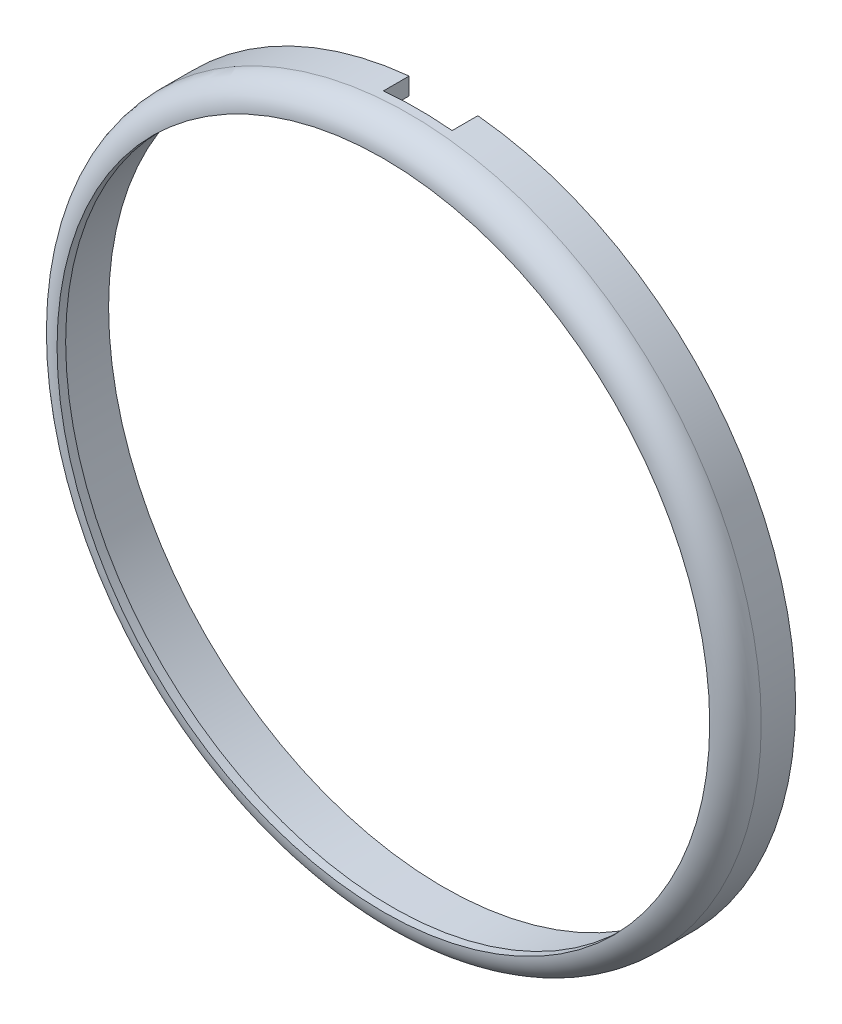
ISO-10303-21;
HEADER;
FILE_DESCRIPTION(('STEP AP214'),'2;1');
FILE_NAME('part.step','',(''),(''),'','','');
FILE_SCHEMA(('AUTOMOTIVE_DESIGN { 1 0 10303 214 1 1 1 1 }'));
ENDSEC;
DATA;
#1=APPLICATION_CONTEXT('core data for automotive mechanical design processes');
#2=APPLICATION_PROTOCOL_DEFINITION('international standard','automotive_design',2000,#1);
#3=PRODUCT_CONTEXT('',#1,'mechanical');
#4=PRODUCT('Part','Part','',(#3));
#5=PRODUCT_RELATED_PRODUCT_CATEGORY('part','',(#4));
#6=PRODUCT_DEFINITION_FORMATION('','',#4);
#7=PRODUCT_DEFINITION_CONTEXT('part definition',#1,'design');
#8=PRODUCT_DEFINITION('design','',#6,#7);
#9=PRODUCT_DEFINITION_SHAPE('','',#8);
#10=(LENGTH_UNIT() NAMED_UNIT(*) SI_UNIT(.MILLI.,.METRE.));
#11=(NAMED_UNIT(*) PLANE_ANGLE_UNIT() SI_UNIT($,.RADIAN.));
#12=(NAMED_UNIT(*) SI_UNIT($,.STERADIAN.) SOLID_ANGLE_UNIT());
#13=UNCERTAINTY_MEASURE_WITH_UNIT(LENGTH_MEASURE(1.E-05),#10,'distance_accuracy_value','');
#14=(GEOMETRIC_REPRESENTATION_CONTEXT(3) GLOBAL_UNCERTAINTY_ASSIGNED_CONTEXT((#13)) GLOBAL_UNIT_ASSIGNED_CONTEXT((#10,
#11,#12)) REPRESENTATION_CONTEXT('',''));
#15=CARTESIAN_POINT('',(0.,0.,0.));
#16=DIRECTION('',(0.,0.,1.));
#17=DIRECTION('',(1.,0.,0.));
#18=AXIS2_PLACEMENT_3D('',#15,#16,#17);
#19=CARTESIAN_POINT('',(0.,0.,3.5));
#20=DIRECTION('',(0.,0.,-1.));
#21=DIRECTION('',(-1.,0.,0.));
#22=AXIS2_PLACEMENT_3D('',#19,#20,#21);
#23=CYLINDRICAL_SURFACE('',#22,20.5);
#24=CARTESIAN_POINT('',(0.,0.,2.));
#25=DIRECTION('',(0.,0.,1.));
#26=DIRECTION('',(1.,0.,0.));
#27=AXIS2_PLACEMENT_3D('',#24,#25,#26);
#28=CIRCLE('',#27,20.5);
#29=CARTESIAN_POINT('',(20.5,0.,2.));
#30=VERTEX_POINT('',#29);
#31=EDGE_CURVE('E11',#30,#30,#28,.F.);
#32=ORIENTED_EDGE('',*,*,#31,.T.);
#33=EDGE_LOOP('',(#32));
#34=FACE_BOUND('',#33,.T.);
#35=CARTESIAN_POINT('',(0.,0.,0.));
#36=DIRECTION('',(0.,0.,1.));
#37=DIRECTION('',(1.,0.,0.));
#38=AXIS2_PLACEMENT_3D('',#35,#36,#37);
#39=CIRCLE('',#38,20.5);
#40=CARTESIAN_POINT('',(-2.,20.4022057631032,0.));
#41=VERTEX_POINT('',#40);
#42=CARTESIAN_POINT('',(2.,20.4022057631032,0.));
#43=VERTEX_POINT('',#42);
#44=EDGE_CURVE('E104',#41,#43,#39,.T.);
#45=ORIENTED_EDGE('',*,*,#44,.T.);
#46=DIRECTION('',(0.,0.,-1.));
#47=VECTOR('',#46,1.);
#48=CARTESIAN_POINT('',(2.,20.4022057631032,3.5));
#49=LINE('',#48,#47);
#50=CARTESIAN_POINT('',(2.,20.4022057631032,1.5));
#51=VERTEX_POINT('',#50);
#52=EDGE_CURVE('E93',#43,#51,#49,.F.);
#53=ORIENTED_EDGE('',*,*,#52,.T.);
#54=CARTESIAN_POINT('',(0.,0.,1.5));
#55=DIRECTION('',(0.,0.,1.));
#56=DIRECTION('',(1.,0.,0.));
#57=AXIS2_PLACEMENT_3D('',#54,#55,#56);
#58=CIRCLE('',#57,20.5);
#59=CARTESIAN_POINT('',(-2.,20.4022057631032,1.5));
#60=VERTEX_POINT('',#59);
#61=EDGE_CURVE('E106',#51,#60,#58,.T.);
#62=ORIENTED_EDGE('',*,*,#61,.T.);
#63=DIRECTION('',(0.,0.,-1.));
#64=VECTOR('',#63,1.);
#65=CARTESIAN_POINT('',(-2.,20.4022057631032,3.5));
#66=LINE('',#65,#64);
#67=EDGE_CURVE('E100',#60,#41,#66,.T.);
#68=ORIENTED_EDGE('',*,*,#67,.T.);
#69=EDGE_LOOP('',(#45,#53,#62,#68));
#70=FACE_BOUND('',#69,.T.);
#71=ADVANCED_FACE('F36',(#34,#70),#23,.T.);
#72=CARTESIAN_POINT('',(0.,0.,0.));
#73=DIRECTION('',(0.,0.,1.));
#74=DIRECTION('',(1.,0.,0.));
#75=AXIS2_PLACEMENT_3D('',#72,#73,#74);
#76=PLANE('',#75);
#77=DIRECTION('',(0.,1.,0.));
#78=VECTOR('',#77,1.);
#79=CARTESIAN_POINT('',(-2.,10.,0.));
#80=LINE('',#79,#78);
#81=CARTESIAN_POINT('',(-2.,19.3971647412708,0.));
#82=VERTEX_POINT('',#81);
#83=EDGE_CURVE('E87',#82,#41,#80,.T.);
#84=ORIENTED_EDGE('',*,*,#83,.F.);
#85=CARTESIAN_POINT('',(0.,0.,0.));
#86=DIRECTION('',(0.,0.,-1.));
#87=DIRECTION('',(-1.,0.,0.));
#88=AXIS2_PLACEMENT_3D('',#85,#86,#87);
#89=CIRCLE('',#88,19.5);
#90=CARTESIAN_POINT('',(2.,19.3971647412708,0.));
#91=VERTEX_POINT('',#90);
#92=EDGE_CURVE('E51',#91,#82,#89,.T.);
#93=ORIENTED_EDGE('',*,*,#92,.F.);
#94=DIRECTION('',(0.,1.,0.));
#95=VECTOR('',#94,1.);
#96=CARTESIAN_POINT('',(2.,10.,0.));
#97=LINE('',#96,#95);
#98=EDGE_CURVE('E81',#91,#43,#97,.T.);
#99=ORIENTED_EDGE('',*,*,#98,.T.);
#100=ORIENTED_EDGE('',*,*,#44,.F.);
#101=EDGE_LOOP('',(#84,#93,#99,#100));
#102=FACE_BOUND('',#101,.T.);
#103=ADVANCED_FACE('F85',(#102),#76,.F.);
#104=CARTESIAN_POINT('',(-2.,10.,1.5));
#105=DIRECTION('',(0.,0.,1.));
#106=DIRECTION('',(1.,0.,0.));
#107=AXIS2_PLACEMENT_3D('',#104,#105,#106);
#108=PLANE('',#107);
#109=DIRECTION('',(0.,1.,0.));
#110=VECTOR('',#109,1.);
#111=CARTESIAN_POINT('',(2.,10.,1.5));
#112=LINE('',#111,#110);
#113=CARTESIAN_POINT('',(2.,19.3971647412708,1.5));
#114=VERTEX_POINT('',#113);
#115=EDGE_CURVE('E59',#114,#51,#112,.T.);
#116=ORIENTED_EDGE('',*,*,#115,.F.);
#117=CARTESIAN_POINT('',(0.,0.,1.5));
#118=DIRECTION('',(0.,0.,1.));
#119=DIRECTION('',(1.,0.,0.));
#120=AXIS2_PLACEMENT_3D('',#117,#118,#119);
#121=CIRCLE('',#120,19.5);
#122=CARTESIAN_POINT('',(-2.,19.3971647412708,1.5));
#123=VERTEX_POINT('',#122);
#124=EDGE_CURVE('E79',#114,#123,#121,.T.);
#125=ORIENTED_EDGE('',*,*,#124,.T.);
#126=DIRECTION('',(0.,1.,0.));
#127=VECTOR('',#126,1.);
#128=CARTESIAN_POINT('',(-2.,10.,1.5));
#129=LINE('',#128,#127);
#130=EDGE_CURVE('E96',#123,#60,#129,.T.);
#131=ORIENTED_EDGE('',*,*,#130,.T.);
#132=ORIENTED_EDGE('',*,*,#61,.F.);
#133=EDGE_LOOP('',(#116,#125,#131,#132));
#134=FACE_BOUND('',#133,.T.);
#135=ADVANCED_FACE('F113',(#134),#108,.F.);
#136=CARTESIAN_POINT('',(2.,10.,1.5));
#137=DIRECTION('',(1.,0.,0.));
#138=DIRECTION('',(0.,0.,-1.));
#139=AXIS2_PLACEMENT_3D('',#136,#137,#138);
#140=PLANE('',#139);
#141=ORIENTED_EDGE('',*,*,#98,.F.);
#142=DIRECTION('',(0.,0.,-1.));
#143=VECTOR('',#142,1.);
#144=CARTESIAN_POINT('',(2.,19.3971647412708,3.));
#145=LINE('',#144,#143);
#146=EDGE_CURVE('E76',#91,#114,#145,.F.);
#147=ORIENTED_EDGE('',*,*,#146,.T.);
#148=ORIENTED_EDGE('',*,*,#115,.T.);
#149=ORIENTED_EDGE('',*,*,#52,.F.);
#150=EDGE_LOOP('',(#141,#147,#148,#149));
#151=FACE_BOUND('',#150,.T.);
#152=ADVANCED_FACE('F91',(#151),#140,.F.);
#153=CARTESIAN_POINT('',(-2.,10.,0.));
#154=DIRECTION('',(-1.,0.,0.));
#155=DIRECTION('',(0.,0.,1.));
#156=AXIS2_PLACEMENT_3D('',#153,#154,#155);
#157=PLANE('',#156);
#158=ORIENTED_EDGE('',*,*,#130,.F.);
#159=DIRECTION('',(0.,0.,-1.));
#160=VECTOR('',#159,1.);
#161=CARTESIAN_POINT('',(-2.,19.3971647412708,3.));
#162=LINE('',#161,#160);
#163=EDGE_CURVE('E44',#123,#82,#162,.T.);
#164=ORIENTED_EDGE('',*,*,#163,.T.);
#165=ORIENTED_EDGE('',*,*,#83,.T.);
#166=ORIENTED_EDGE('',*,*,#67,.F.);
#167=EDGE_LOOP('',(#158,#164,#165,#166));
#168=FACE_BOUND('',#167,.T.);
#169=ADVANCED_FACE('F110',(#168),#157,.F.);
#170=CARTESIAN_POINT('',(0.,0.,3.));
#171=DIRECTION('',(0.,0.,-1.));
#172=DIRECTION('',(-1.,0.,0.));
#173=AXIS2_PLACEMENT_3D('',#170,#171,#172);
#174=CYLINDRICAL_SURFACE('',#173,19.5);
#175=CARTESIAN_POINT('',(0.,0.,3.));
#176=DIRECTION('',(0.,0.,-1.));
#177=DIRECTION('',(-1.,0.,0.));
#178=AXIS2_PLACEMENT_3D('',#175,#176,#177);
#179=CIRCLE('',#178,19.5);
#180=CARTESIAN_POINT('',(-19.5,0.,3.));
#181=VERTEX_POINT('',#180);
#182=EDGE_CURVE('E88',#181,#181,#179,.T.);
#183=ORIENTED_EDGE('',*,*,#182,.F.);
#184=EDGE_LOOP('',(#183));
#185=FACE_BOUND('',#184,.T.);
#186=ORIENTED_EDGE('',*,*,#92,.T.);
#187=ORIENTED_EDGE('',*,*,#163,.F.);
#188=ORIENTED_EDGE('',*,*,#124,.F.);
#189=ORIENTED_EDGE('',*,*,#146,.F.);
#190=EDGE_LOOP('',(#186,#187,#188,#189));
#191=FACE_BOUND('',#190,.T.);
#192=ADVANCED_FACE('F77',(#185,#191),#174,.F.);
#193=CARTESIAN_POINT('',(0.,0.,3.));
#194=DIRECTION('',(0.,0.,-1.));
#195=DIRECTION('',(-1.,0.,0.));
#196=AXIS2_PLACEMENT_3D('',#193,#194,#195);
#197=PLANE('',#196);
#198=CARTESIAN_POINT('',(0.,0.,3.));
#199=DIRECTION('',(0.,0.,-1.));
#200=DIRECTION('',(-1.,0.,0.));
#201=AXIS2_PLACEMENT_3D('',#198,#199,#200);
#202=CIRCLE('',#201,19.);
#203=CARTESIAN_POINT('',(-19.,0.,3.));
#204=VERTEX_POINT('',#203);
#205=EDGE_CURVE('E121',#204,#204,#202,.T.);
#206=ORIENTED_EDGE('',*,*,#205,.F.);
#207=EDGE_LOOP('',(#206));
#208=FACE_BOUND('',#207,.T.);
#209=ORIENTED_EDGE('',*,*,#182,.T.);
#210=EDGE_LOOP('',(#209));
#211=FACE_BOUND('',#210,.T.);
#212=ADVANCED_FACE('F127',(#208,#211),#197,.T.);
#213=CARTESIAN_POINT('',(0.,0.,6.));
#214=DIRECTION('',(0.,0.,-1.));
#215=DIRECTION('',(-1.,0.,0.));
#216=AXIS2_PLACEMENT_3D('',#213,#214,#215);
#217=CYLINDRICAL_SURFACE('',#216,19.);
#218=CARTESIAN_POINT('',(0.,0.,3.5));
#219=DIRECTION('',(0.,0.,1.));
#220=DIRECTION('',(1.,0.,0.));
#221=AXIS2_PLACEMENT_3D('',#218,#219,#220);
#222=CIRCLE('',#221,19.);
#223=CARTESIAN_POINT('',(19.,0.,3.5));
#224=VERTEX_POINT('',#223);
#225=EDGE_CURVE('E89',#224,#224,#222,.T.);
#226=ORIENTED_EDGE('',*,*,#225,.T.);
#227=EDGE_LOOP('',(#226));
#228=FACE_BOUND('',#227,.T.);
#229=ORIENTED_EDGE('',*,*,#205,.T.);
#230=EDGE_LOOP('',(#229));
#231=FACE_BOUND('',#230,.T.);
#232=ADVANCED_FACE('F125',(#228,#231),#217,.F.);
#233=CARTESIAN_POINT('',(0.,0.,2.));
#234=DIRECTION('',(0.,0.,1.));
#235=DIRECTION('',(1.,0.,0.));
#236=AXIS2_PLACEMENT_3D('',#233,#234,#235);
#237=TOROIDAL_SURFACE('',#236,19.,1.5);
#238=ORIENTED_EDGE('',*,*,#31,.F.);
#239=EDGE_LOOP('',(#238));
#240=FACE_BOUND('',#239,.T.);
#241=ORIENTED_EDGE('',*,*,#225,.F.);
#242=EDGE_LOOP('',(#241));
#243=FACE_BOUND('',#242,.T.);
#244=ADVANCED_FACE('F38',(#240,#243),#237,.T.);
#245=CLOSED_SHELL('',(#71,#103,#135,#152,#169,#192,#212,#232,#244));
#246=MANIFOLD_SOLID_BREP('B2',#245);
#247=ADVANCED_BREP_SHAPE_REPRESENTATION('',(#18,#246),#14);
#248=SHAPE_DEFINITION_REPRESENTATION(#9,#247);
ENDSEC;
END-ISO-10303-21;
